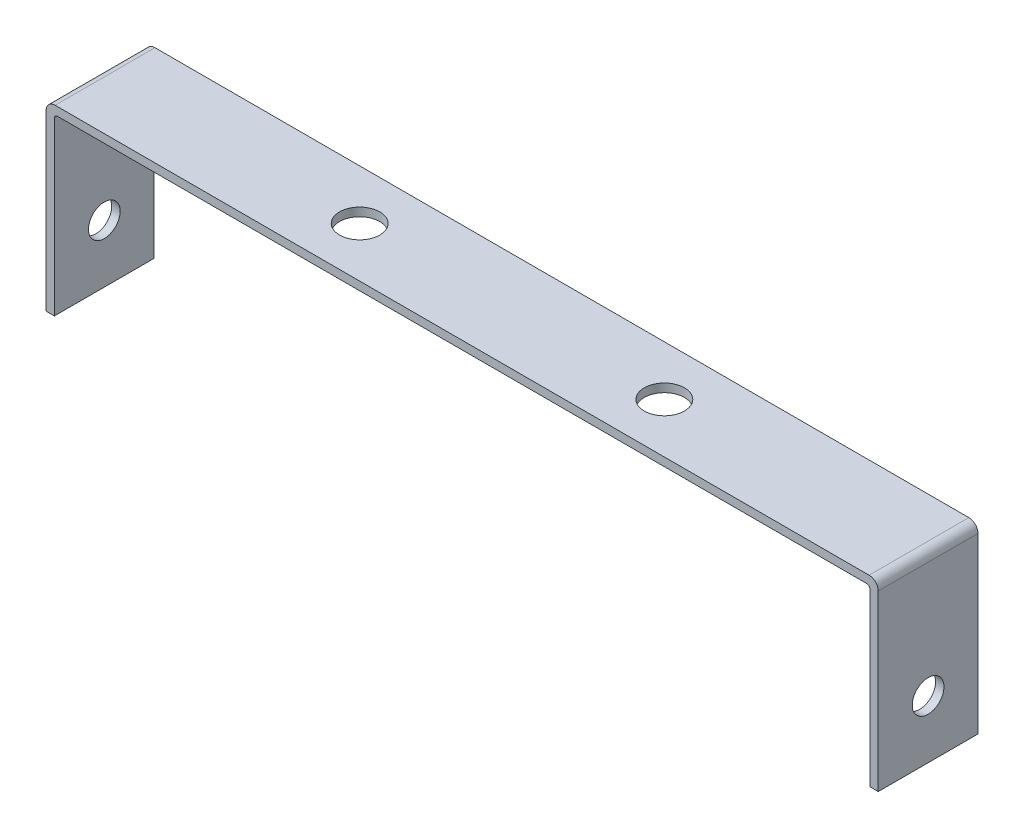
ISO-10303-21;
HEADER;
FILE_DESCRIPTION(('STEP AP214'),'2;1');
FILE_NAME('part.step','',(''),(''),'','','');
FILE_SCHEMA(('AUTOMOTIVE_DESIGN { 1 0 10303 214 1 1 1 1 }'));
ENDSEC;
DATA;
#1=APPLICATION_CONTEXT('core data for automotive mechanical design processes');
#2=APPLICATION_PROTOCOL_DEFINITION('international standard','automotive_design',2000,#1);
#3=PRODUCT_CONTEXT('',#1,'mechanical');
#4=PRODUCT('Part','Part','',(#3));
#5=PRODUCT_RELATED_PRODUCT_CATEGORY('part','',(#4));
#6=PRODUCT_DEFINITION_FORMATION('','',#4);
#7=PRODUCT_DEFINITION_CONTEXT('part definition',#1,'design');
#8=PRODUCT_DEFINITION('design','',#6,#7);
#9=PRODUCT_DEFINITION_SHAPE('','',#8);
#10=(LENGTH_UNIT() NAMED_UNIT(*) SI_UNIT(.MILLI.,.METRE.));
#11=(NAMED_UNIT(*) PLANE_ANGLE_UNIT() SI_UNIT($,.RADIAN.));
#12=(NAMED_UNIT(*) SI_UNIT($,.STERADIAN.) SOLID_ANGLE_UNIT());
#13=UNCERTAINTY_MEASURE_WITH_UNIT(LENGTH_MEASURE(1.E-05),#10,'distance_accuracy_value','');
#14=(GEOMETRIC_REPRESENTATION_CONTEXT(3) GLOBAL_UNCERTAINTY_ASSIGNED_CONTEXT((#13)) GLOBAL_UNIT_ASSIGNED_CONTEXT((#10,
#11,#12)) REPRESENTATION_CONTEXT('',''));
#15=CARTESIAN_POINT('',(0.,0.,0.));
#16=DIRECTION('',(0.,0.,1.));
#17=DIRECTION('',(1.,0.,0.));
#18=AXIS2_PLACEMENT_3D('',#15,#16,#17);
#19=CARTESIAN_POINT('',(0.,1.38,0.));
#20=DIRECTION('',(0.,1.,0.));
#21=DIRECTION('',(0.,0.,1.));
#22=AXIS2_PLACEMENT_3D('',#19,#20,#21);
#23=PLANE('',#22);
#24=CARTESIAN_POINT('',(-30.1412780743433,1.38,-20.6504197016728));
#25=DIRECTION('',(0.,1.,0.));
#26=DIRECTION('',(0.,0.,1.));
#27=AXIS2_PLACEMENT_3D('',#24,#25,#26);
#28=CIRCLE('',#27,3.3);
#29=CARTESIAN_POINT('',(-30.1412780743433,1.38,-17.3504197016728));
#30=VERTEX_POINT('',#29);
#31=EDGE_CURVE('E197',#30,#30,#28,.T.);
#32=ORIENTED_EDGE('',*,*,#31,.F.);
#33=EDGE_LOOP('',(#32));
#34=FACE_BOUND('',#33,.T.);
#35=DIRECTION('',(-1.,0.,0.));
#36=VECTOR('',#35,1.);
#37=CARTESIAN_POINT('',(-72.0412780743433,1.38,-28.8354197016728));
#38=LINE('',#37,#36);
#39=CARTESIAN_POINT('',(61.6387219256567,1.38,-28.8354197016728));
#40=VERTEX_POINT('',#39);
#41=CARTESIAN_POINT('',(-71.9212780743433,1.38,-28.8354197016728));
#42=VERTEX_POINT('',#41);
#43=EDGE_CURVE('E206',#40,#42,#38,.T.);
#44=ORIENTED_EDGE('',*,*,#43,.T.);
#45=DIRECTION('',(0.,0.,1.));
#46=VECTOR('',#45,1.);
#47=CARTESIAN_POINT('',(-71.9212780743433,1.38,0.));
#48=LINE('',#47,#46);
#49=CARTESIAN_POINT('',(-71.9212780743433,1.38,-12.4654197016728));
#50=VERTEX_POINT('',#49);
#51=EDGE_CURVE('E285',#42,#50,#48,.T.);
#52=ORIENTED_EDGE('',*,*,#51,.T.);
#53=DIRECTION('',(1.,0.,0.));
#54=VECTOR('',#53,1.);
#55=CARTESIAN_POINT('',(-72.0412780743433,1.38,-12.4654197016728));
#56=LINE('',#55,#54);
#57=CARTESIAN_POINT('',(61.6387219256567,1.38,-12.4654197016728));
#58=VERTEX_POINT('',#57);
#59=EDGE_CURVE('E203',#50,#58,#56,.T.);
#60=ORIENTED_EDGE('',*,*,#59,.T.);
#61=DIRECTION('',(0.,0.,-1.));
#62=VECTOR('',#61,1.);
#63=CARTESIAN_POINT('',(61.6387219256567,1.38,0.));
#64=LINE('',#63,#62);
#65=EDGE_CURVE('E210',#58,#40,#64,.T.);
#66=ORIENTED_EDGE('',*,*,#65,.T.);
#67=EDGE_LOOP('',(#44,#52,#60,#66));
#68=FACE_BOUND('',#67,.T.);
#69=CARTESIAN_POINT('',(19.8587219256567,1.38,-20.6504197016728));
#70=DIRECTION('',(0.,1.,0.));
#71=DIRECTION('',(0.,0.,1.));
#72=AXIS2_PLACEMENT_3D('',#69,#70,#71);
#73=CIRCLE('',#72,3.3);
#74=CARTESIAN_POINT('',(19.8587219256567,1.38,-17.3504197016728));
#75=VERTEX_POINT('',#74);
#76=EDGE_CURVE('E191',#75,#75,#73,.T.);
#77=ORIENTED_EDGE('',*,*,#76,.F.);
#78=EDGE_LOOP('',(#77));
#79=FACE_BOUND('',#78,.T.);
#80=ADVANCED_FACE('F37',(#34,#68,#79),#23,.T.);
#81=CARTESIAN_POINT('',(0.,0.,0.));
#82=DIRECTION('',(0.,1.,0.));
#83=DIRECTION('',(0.,0.,1.));
#84=AXIS2_PLACEMENT_3D('',#81,#82,#83);
#85=PLANE('',#84);
#86=CARTESIAN_POINT('',(-30.1412780743433,0.,-20.6504197016728));
#87=DIRECTION('',(0.,1.,0.));
#88=DIRECTION('',(0.,0.,1.));
#89=AXIS2_PLACEMENT_3D('',#86,#87,#88);
#90=CIRCLE('',#89,3.3);
#91=CARTESIAN_POINT('',(-30.1412780743433,0.,-17.3504197016728));
#92=VERTEX_POINT('',#91);
#93=EDGE_CURVE('E194',#92,#92,#90,.T.);
#94=ORIENTED_EDGE('',*,*,#93,.T.);
#95=EDGE_LOOP('',(#94));
#96=FACE_BOUND('',#95,.T.);
#97=DIRECTION('',(1.,0.,0.));
#98=VECTOR('',#97,1.);
#99=CARTESIAN_POINT('',(-72.0412780743433,0.,-12.4654197016728));
#100=LINE('',#99,#98);
#101=CARTESIAN_POINT('',(-71.5412780743433,0.,-12.4654197016728));
#102=VERTEX_POINT('',#101);
#103=CARTESIAN_POINT('',(61.2587219256567,0.,-12.4654197016728));
#104=VERTEX_POINT('',#103);
#105=EDGE_CURVE('E200',#102,#104,#100,.T.);
#106=ORIENTED_EDGE('',*,*,#105,.F.);
#107=DIRECTION('',(0.,0.,1.));
#108=VECTOR('',#107,1.);
#109=CARTESIAN_POINT('',(-71.5412780743433,0.,0.));
#110=LINE('',#109,#108);
#111=CARTESIAN_POINT('',(-71.5412780743433,0.,-28.8354197016728));
#112=VERTEX_POINT('',#111);
#113=EDGE_CURVE('E221',#102,#112,#110,.F.);
#114=ORIENTED_EDGE('',*,*,#113,.T.);
#115=DIRECTION('',(-1.,0.,0.));
#116=VECTOR('',#115,1.);
#117=CARTESIAN_POINT('',(-72.0412780743433,0.,-28.8354197016728));
#118=LINE('',#117,#116);
#119=CARTESIAN_POINT('',(61.2587219256567,0.,-28.8354197016728));
#120=VERTEX_POINT('',#119);
#121=EDGE_CURVE('E207',#120,#112,#118,.T.);
#122=ORIENTED_EDGE('',*,*,#121,.F.);
#123=DIRECTION('',(0.,0.,-1.));
#124=VECTOR('',#123,1.);
#125=CARTESIAN_POINT('',(61.2587219256567,0.,0.));
#126=LINE('',#125,#124);
#127=EDGE_CURVE('E219',#120,#104,#126,.F.);
#128=ORIENTED_EDGE('',*,*,#127,.T.);
#129=EDGE_LOOP('',(#106,#114,#122,#128));
#130=FACE_BOUND('',#129,.T.);
#131=CARTESIAN_POINT('',(19.8587219256567,0.,-20.6504197016728));
#132=DIRECTION('',(0.,1.,0.));
#133=DIRECTION('',(0.,0.,1.));
#134=AXIS2_PLACEMENT_3D('',#131,#132,#133);
#135=CIRCLE('',#134,3.3);
#136=CARTESIAN_POINT('',(19.8587219256567,0.,-17.3504197016728));
#137=VERTEX_POINT('',#136);
#138=EDGE_CURVE('E186',#137,#137,#135,.T.);
#139=ORIENTED_EDGE('',*,*,#138,.T.);
#140=EDGE_LOOP('',(#139));
#141=FACE_BOUND('',#140,.T.);
#142=ADVANCED_FACE('F237',(#96,#130,#141),#85,.F.);
#143=CARTESIAN_POINT('',(-72.0412780743433,1.38,-12.4654197016728));
#144=DIRECTION('',(0.,0.,-1.));
#145=DIRECTION('',(-1.,0.,0.));
#146=AXIS2_PLACEMENT_3D('',#143,#144,#145);
#147=PLANE('',#146);
#148=ORIENTED_EDGE('',*,*,#59,.F.);
#149=CARTESIAN_POINT('',(-71.9212780743433,-0.12,-12.4654197016728));
#150=DIRECTION('',(0.,0.,-1.));
#151=DIRECTION('',(-1.,0.,0.));
#152=AXIS2_PLACEMENT_3D('',#149,#150,#151);
#153=CIRCLE('',#152,1.5);
#154=CARTESIAN_POINT('',(-73.4212780743433,-0.119999999999999,-12.4654197016728));
#155=VERTEX_POINT('',#154);
#156=EDGE_CURVE('E284',#50,#155,#153,.F.);
#157=ORIENTED_EDGE('',*,*,#156,.T.);
#158=DIRECTION('',(0.,1.,0.));
#159=VECTOR('',#158,1.);
#160=CARTESIAN_POINT('',(-73.4212780743433,-28.62,-12.4654197016728));
#161=LINE('',#160,#159);
#162=CARTESIAN_POINT('',(-73.4212780743433,-28.62,-12.4654197016728));
#163=VERTEX_POINT('',#162);
#164=EDGE_CURVE('E179',#163,#155,#161,.T.);
#165=ORIENTED_EDGE('',*,*,#164,.F.);
#166=DIRECTION('',(1.,0.,0.));
#167=VECTOR('',#166,1.);
#168=CARTESIAN_POINT('',(-72.0412780743433,-28.62,-12.4654197016728));
#169=LINE('',#168,#167);
#170=CARTESIAN_POINT('',(-72.0412780743433,-28.62,-12.4654197016728));
#171=VERTEX_POINT('',#170);
#172=EDGE_CURVE('E173',#163,#171,#169,.T.);
#173=ORIENTED_EDGE('',*,*,#172,.T.);
#174=DIRECTION('',(0.,1.,0.));
#175=VECTOR('',#174,1.);
#176=CARTESIAN_POINT('',(-72.0412780743433,-28.62,-12.4654197016728));
#177=LINE('',#176,#175);
#178=CARTESIAN_POINT('',(-72.0412780743433,-0.5,-12.4654197016728));
#179=VERTEX_POINT('',#178);
#180=EDGE_CURVE('E182',#171,#179,#177,.T.);
#181=ORIENTED_EDGE('',*,*,#180,.T.);
#182=CARTESIAN_POINT('',(-71.5412780743433,-0.5,-12.4654197016728));
#183=DIRECTION('',(0.,0.,-1.));
#184=DIRECTION('',(-1.,0.,0.));
#185=AXIS2_PLACEMENT_3D('',#182,#183,#184);
#186=CIRCLE('',#185,0.5);
#187=EDGE_CURVE('E226',#179,#102,#186,.T.);
#188=ORIENTED_EDGE('',*,*,#187,.T.);
#189=ORIENTED_EDGE('',*,*,#105,.T.);
#190=CARTESIAN_POINT('',(61.2587219256567,-0.5,-12.4654197016728));
#191=DIRECTION('',(0.,0.,-1.));
#192=DIRECTION('',(-1.,0.,0.));
#193=AXIS2_PLACEMENT_3D('',#190,#191,#192);
#194=CIRCLE('',#193,0.5);
#195=CARTESIAN_POINT('',(61.7587219256567,-0.5,-12.4654197016728));
#196=VERTEX_POINT('',#195);
#197=EDGE_CURVE('E11',#104,#196,#194,.T.);
#198=ORIENTED_EDGE('',*,*,#197,.T.);
#199=DIRECTION('',(0.,1.,0.));
#200=VECTOR('',#199,1.);
#201=CARTESIAN_POINT('',(61.7587219256567,-28.62,-12.4654197016728));
#202=LINE('',#201,#200);
#203=CARTESIAN_POINT('',(61.7587219256567,-28.62,-12.4654197016728));
#204=VERTEX_POINT('',#203);
#205=EDGE_CURVE('E123',#204,#196,#202,.T.);
#206=ORIENTED_EDGE('',*,*,#205,.F.);
#207=DIRECTION('',(1.,0.,0.));
#208=VECTOR('',#207,1.);
#209=CARTESIAN_POINT('',(61.7587219256567,-28.62,-12.4654197016728));
#210=LINE('',#209,#208);
#211=CARTESIAN_POINT('',(63.1387219256567,-28.62,-12.4654197016728));
#212=VERTEX_POINT('',#211);
#213=EDGE_CURVE('E128',#204,#212,#210,.T.);
#214=ORIENTED_EDGE('',*,*,#213,.T.);
#215=DIRECTION('',(0.,1.,0.));
#216=VECTOR('',#215,1.);
#217=CARTESIAN_POINT('',(63.1387219256567,-28.62,-12.4654197016728));
#218=LINE('',#217,#216);
#219=CARTESIAN_POINT('',(63.1387219256567,-0.119999999999999,-12.4654197016728));
#220=VERTEX_POINT('',#219);
#221=EDGE_CURVE('E131',#212,#220,#218,.T.);
#222=ORIENTED_EDGE('',*,*,#221,.T.);
#223=CARTESIAN_POINT('',(61.6387219256567,-0.12,-12.4654197016728));
#224=DIRECTION('',(0.,0.,-1.));
#225=DIRECTION('',(-1.,0.,0.));
#226=AXIS2_PLACEMENT_3D('',#223,#224,#225);
#227=CIRCLE('',#226,1.5);
#228=EDGE_CURVE('E281',#220,#58,#227,.F.);
#229=ORIENTED_EDGE('',*,*,#228,.T.);
#230=EDGE_LOOP('',(#148,#157,#165,#173,#181,#188,#189,#198,#206,#214,#222,#229));
#231=FACE_BOUND('',#230,.T.);
#232=ADVANCED_FACE('F126',(#231),#147,.F.);
#233=CARTESIAN_POINT('',(-72.0412780743433,1.38,-28.8354197016728));
#234=DIRECTION('',(0.,0.,1.));
#235=DIRECTION('',(1.,0.,0.));
#236=AXIS2_PLACEMENT_3D('',#233,#234,#235);
#237=PLANE('',#236);
#238=DIRECTION('',(0.,1.,0.));
#239=VECTOR('',#238,1.);
#240=CARTESIAN_POINT('',(-73.4212780743433,-28.62,-28.8354197016728));
#241=LINE('',#240,#239);
#242=CARTESIAN_POINT('',(-73.4212780743433,-28.62,-28.8354197016728));
#243=VERTEX_POINT('',#242);
#244=CARTESIAN_POINT('',(-73.4212780743433,-0.119999999999999,-28.8354197016728));
#245=VERTEX_POINT('',#244);
#246=EDGE_CURVE('E190',#243,#245,#241,.T.);
#247=ORIENTED_EDGE('',*,*,#246,.T.);
#248=CARTESIAN_POINT('',(-71.9212780743433,-0.12,-28.8354197016728));
#249=DIRECTION('',(0.,0.,1.));
#250=DIRECTION('',(1.,0.,0.));
#251=AXIS2_PLACEMENT_3D('',#248,#249,#250);
#252=CIRCLE('',#251,1.5);
#253=EDGE_CURVE('E295',#245,#42,#252,.F.);
#254=ORIENTED_EDGE('',*,*,#253,.T.);
#255=ORIENTED_EDGE('',*,*,#43,.F.);
#256=CARTESIAN_POINT('',(61.6387219256567,-0.12,-28.8354197016728));
#257=DIRECTION('',(0.,0.,1.));
#258=DIRECTION('',(1.,0.,0.));
#259=AXIS2_PLACEMENT_3D('',#256,#257,#258);
#260=CIRCLE('',#259,1.5);
#261=CARTESIAN_POINT('',(63.1387219256567,-0.119999999999999,-28.8354197016728));
#262=VERTEX_POINT('',#261);
#263=EDGE_CURVE('E293',#40,#262,#260,.F.);
#264=ORIENTED_EDGE('',*,*,#263,.T.);
#265=DIRECTION('',(0.,1.,0.));
#266=VECTOR('',#265,1.);
#267=CARTESIAN_POINT('',(63.1387219256567,-28.62,-28.8354197016728));
#268=LINE('',#267,#266);
#269=CARTESIAN_POINT('',(63.1387219256567,-28.62,-28.8354197016728));
#270=VERTEX_POINT('',#269);
#271=EDGE_CURVE('E158',#270,#262,#268,.T.);
#272=ORIENTED_EDGE('',*,*,#271,.F.);
#273=DIRECTION('',(-1.,0.,0.));
#274=VECTOR('',#273,1.);
#275=CARTESIAN_POINT('',(61.7587219256567,-28.62,-28.8354197016728));
#276=LINE('',#275,#274);
#277=CARTESIAN_POINT('',(61.7587219256567,-28.62,-28.8354197016728));
#278=VERTEX_POINT('',#277);
#279=EDGE_CURVE('E132',#270,#278,#276,.T.);
#280=ORIENTED_EDGE('',*,*,#279,.T.);
#281=DIRECTION('',(0.,1.,0.));
#282=VECTOR('',#281,1.);
#283=CARTESIAN_POINT('',(61.7587219256567,-28.62,-28.8354197016728));
#284=LINE('',#283,#282);
#285=CARTESIAN_POINT('',(61.7587219256567,-0.5,-28.8354197016728));
#286=VERTEX_POINT('',#285);
#287=EDGE_CURVE('E146',#278,#286,#284,.T.);
#288=ORIENTED_EDGE('',*,*,#287,.T.);
#289=CARTESIAN_POINT('',(61.2587219256567,-0.5,-28.8354197016728));
#290=DIRECTION('',(0.,0.,1.));
#291=DIRECTION('',(1.,0.,0.));
#292=AXIS2_PLACEMENT_3D('',#289,#290,#291);
#293=CIRCLE('',#292,0.5);
#294=EDGE_CURVE('E45',#286,#120,#293,.T.);
#295=ORIENTED_EDGE('',*,*,#294,.T.);
#296=ORIENTED_EDGE('',*,*,#121,.T.);
#297=CARTESIAN_POINT('',(-71.5412780743433,-0.5,-28.8354197016728));
#298=DIRECTION('',(0.,0.,1.));
#299=DIRECTION('',(1.,0.,0.));
#300=AXIS2_PLACEMENT_3D('',#297,#298,#299);
#301=CIRCLE('',#300,0.5);
#302=CARTESIAN_POINT('',(-72.0412780743433,-0.5,-28.8354197016728));
#303=VERTEX_POINT('',#302);
#304=EDGE_CURVE('E228',#112,#303,#301,.T.);
#305=ORIENTED_EDGE('',*,*,#304,.T.);
#306=DIRECTION('',(0.,1.,0.));
#307=VECTOR('',#306,1.);
#308=CARTESIAN_POINT('',(-72.0412780743433,-28.62,-28.8354197016728));
#309=LINE('',#308,#307);
#310=CARTESIAN_POINT('',(-72.0412780743433,-28.62,-28.8354197016728));
#311=VERTEX_POINT('',#310);
#312=EDGE_CURVE('E176',#311,#303,#309,.T.);
#313=ORIENTED_EDGE('',*,*,#312,.F.);
#314=DIRECTION('',(-1.,0.,0.));
#315=VECTOR('',#314,1.);
#316=CARTESIAN_POINT('',(-72.0412780743433,-28.62,-28.8354197016728));
#317=LINE('',#316,#315);
#318=EDGE_CURVE('E167',#311,#243,#317,.T.);
#319=ORIENTED_EDGE('',*,*,#318,.T.);
#320=EDGE_LOOP('',(#247,#254,#255,#264,#272,#280,#288,#295,#296,#305,#313,#319));
#321=FACE_BOUND('',#320,.T.);
#322=ADVANCED_FACE('F233',(#321),#237,.F.);
#323=CARTESIAN_POINT('',(-30.1412780743433,1.38,-20.6504197016728));
#324=DIRECTION('',(0.,-1.,0.));
#325=DIRECTION('',(0.,0.,-1.));
#326=AXIS2_PLACEMENT_3D('',#323,#324,#325);
#327=CYLINDRICAL_SURFACE('',#326,3.3);
#328=ORIENTED_EDGE('',*,*,#31,.T.);
#329=EDGE_LOOP('',(#328));
#330=FACE_BOUND('',#329,.T.);
#331=ORIENTED_EDGE('',*,*,#93,.F.);
#332=EDGE_LOOP('',(#331));
#333=FACE_BOUND('',#332,.T.);
#334=ADVANCED_FACE('F263',(#330,#333),#327,.F.);
#335=CARTESIAN_POINT('',(19.8587219256567,1.38,-20.6504197016728));
#336=DIRECTION('',(0.,-1.,0.));
#337=DIRECTION('',(0.,0.,-1.));
#338=AXIS2_PLACEMENT_3D('',#335,#336,#337);
#339=CYLINDRICAL_SURFACE('',#338,3.3);
#340=ORIENTED_EDGE('',*,*,#76,.T.);
#341=EDGE_LOOP('',(#340));
#342=FACE_BOUND('',#341,.T.);
#343=ORIENTED_EDGE('',*,*,#138,.F.);
#344=EDGE_LOOP('',(#343));
#345=FACE_BOUND('',#344,.T.);
#346=ADVANCED_FACE('F323',(#342,#345),#339,.F.);
#347=CARTESIAN_POINT('',(-72.0412780743433,-28.62,-28.8354197016728));
#348=DIRECTION('',(1.,0.,0.));
#349=DIRECTION('',(0.,0.,-1.));
#350=AXIS2_PLACEMENT_3D('',#347,#348,#349);
#351=PLANE('',#350);
#352=CARTESIAN_POINT('',(-72.0412780743433,-19.12,-20.6504197016728));
#353=DIRECTION('',(1.,0.,0.));
#354=DIRECTION('',(0.,0.,-1.));
#355=AXIS2_PLACEMENT_3D('',#352,#353,#354);
#356=CIRCLE('',#355,2.6);
#357=CARTESIAN_POINT('',(-72.0412780743433,-19.12,-23.2504197016728));
#358=VERTEX_POINT('',#357);
#359=EDGE_CURVE('E147',#358,#358,#356,.T.);
#360=ORIENTED_EDGE('',*,*,#359,.F.);
#361=EDGE_LOOP('',(#360));
#362=FACE_BOUND('',#361,.T.);
#363=ORIENTED_EDGE('',*,*,#312,.T.);
#364=DIRECTION('',(0.,0.,1.));
#365=VECTOR('',#364,1.);
#366=CARTESIAN_POINT('',(-72.0412780743433,-0.5,-28.8354197016728));
#367=LINE('',#366,#365);
#368=EDGE_CURVE('E222',#303,#179,#367,.T.);
#369=ORIENTED_EDGE('',*,*,#368,.T.);
#370=ORIENTED_EDGE('',*,*,#180,.F.);
#371=DIRECTION('',(0.,0.,-1.));
#372=VECTOR('',#371,1.);
#373=CARTESIAN_POINT('',(-72.0412780743433,-28.62,-28.8354197016728));
#374=LINE('',#373,#372);
#375=EDGE_CURVE('E162',#171,#311,#374,.T.);
#376=ORIENTED_EDGE('',*,*,#375,.T.);
#377=EDGE_LOOP('',(#363,#369,#370,#376));
#378=FACE_BOUND('',#377,.T.);
#379=ADVANCED_FACE('F300',(#362,#378),#351,.T.);
#380=CARTESIAN_POINT('',(-73.4212780743433,-28.62,-28.8354197016728));
#381=DIRECTION('',(-1.,0.,0.));
#382=DIRECTION('',(0.,0.,1.));
#383=AXIS2_PLACEMENT_3D('',#380,#381,#382);
#384=PLANE('',#383);
#385=CARTESIAN_POINT('',(-73.4212780743433,-19.12,-20.6504197016728));
#386=DIRECTION('',(-1.,0.,0.));
#387=DIRECTION('',(0.,0.,1.));
#388=AXIS2_PLACEMENT_3D('',#385,#386,#387);
#389=CIRCLE('',#388,2.6);
#390=CARTESIAN_POINT('',(-73.4212780743433,-19.12,-18.0504197016728));
#391=VERTEX_POINT('',#390);
#392=EDGE_CURVE('E460',#391,#391,#389,.T.);
#393=ORIENTED_EDGE('',*,*,#392,.F.);
#394=EDGE_LOOP('',(#393));
#395=FACE_BOUND('',#394,.T.);
#396=ORIENTED_EDGE('',*,*,#164,.T.);
#397=DIRECTION('',(0.,0.,1.));
#398=VECTOR('',#397,1.);
#399=CARTESIAN_POINT('',(-73.4212780743433,-0.119999999999999,-28.8354197016728));
#400=LINE('',#399,#398);
#401=EDGE_CURVE('E287',#155,#245,#400,.F.);
#402=ORIENTED_EDGE('',*,*,#401,.T.);
#403=ORIENTED_EDGE('',*,*,#246,.F.);
#404=DIRECTION('',(0.,0.,1.));
#405=VECTOR('',#404,1.);
#406=CARTESIAN_POINT('',(-73.4212780743433,-28.62,-28.8354197016728));
#407=LINE('',#406,#405);
#408=EDGE_CURVE('E170',#243,#163,#407,.T.);
#409=ORIENTED_EDGE('',*,*,#408,.T.);
#410=EDGE_LOOP('',(#396,#402,#403,#409));
#411=FACE_BOUND('',#410,.T.);
#412=ADVANCED_FACE('F314',(#395,#411),#384,.T.);
#413=CARTESIAN_POINT('',(0.,-28.62,0.));
#414=DIRECTION('',(0.,-1.,0.));
#415=DIRECTION('',(0.,0.,-1.));
#416=AXIS2_PLACEMENT_3D('',#413,#414,#415);
#417=PLANE('',#416);
#418=ORIENTED_EDGE('',*,*,#375,.F.);
#419=ORIENTED_EDGE('',*,*,#172,.F.);
#420=ORIENTED_EDGE('',*,*,#408,.F.);
#421=ORIENTED_EDGE('',*,*,#318,.F.);
#422=EDGE_LOOP('',(#418,#419,#420,#421));
#423=FACE_BOUND('',#422,.T.);
#424=ADVANCED_FACE('F306',(#423),#417,.T.);
#425=CARTESIAN_POINT('',(61.7587219256567,-28.62,-28.8354197016728));
#426=DIRECTION('',(-1.,0.,0.));
#427=DIRECTION('',(0.,0.,1.));
#428=AXIS2_PLACEMENT_3D('',#425,#426,#427);
#429=PLANE('',#428);
#430=CARTESIAN_POINT('',(61.7587219256567,-19.12,-20.6504197016728));
#431=DIRECTION('',(-1.,0.,0.));
#432=DIRECTION('',(0.,0.,1.));
#433=AXIS2_PLACEMENT_3D('',#430,#431,#432);
#434=CIRCLE('',#433,2.6);
#435=CARTESIAN_POINT('',(61.7587219256567,-19.12,-18.0504197016728));
#436=VERTEX_POINT('',#435);
#437=EDGE_CURVE('E150',#436,#436,#434,.T.);
#438=ORIENTED_EDGE('',*,*,#437,.F.);
#439=EDGE_LOOP('',(#438));
#440=FACE_BOUND('',#439,.T.);
#441=ORIENTED_EDGE('',*,*,#205,.T.);
#442=DIRECTION('',(0.,0.,-1.));
#443=VECTOR('',#442,1.);
#444=CARTESIAN_POINT('',(61.7587219256567,-0.5,-28.8354197016728));
#445=LINE('',#444,#443);
#446=EDGE_CURVE('E224',#196,#286,#445,.T.);
#447=ORIENTED_EDGE('',*,*,#446,.T.);
#448=ORIENTED_EDGE('',*,*,#287,.F.);
#449=DIRECTION('',(0.,0.,1.));
#450=VECTOR('',#449,1.);
#451=CARTESIAN_POINT('',(61.7587219256567,-28.62,-28.8354197016728));
#452=LINE('',#451,#450);
#453=EDGE_CURVE('E139',#278,#204,#452,.T.);
#454=ORIENTED_EDGE('',*,*,#453,.T.);
#455=EDGE_LOOP('',(#441,#447,#448,#454));
#456=FACE_BOUND('',#455,.T.);
#457=ADVANCED_FACE('F144',(#440,#456),#429,.T.);
#458=CARTESIAN_POINT('',(63.1387219256567,-28.62,-28.8354197016728));
#459=DIRECTION('',(1.,0.,0.));
#460=DIRECTION('',(0.,0.,-1.));
#461=AXIS2_PLACEMENT_3D('',#458,#459,#460);
#462=PLANE('',#461);
#463=CARTESIAN_POINT('',(63.1387219256567,-19.12,-20.6504197016728));
#464=DIRECTION('',(-1.,0.,0.));
#465=DIRECTION('',(0.,0.,1.));
#466=AXIS2_PLACEMENT_3D('',#463,#464,#465);
#467=CIRCLE('',#466,2.6);
#468=CARTESIAN_POINT('',(63.1387219256567,-19.12,-18.0504197016728));
#469=VERTEX_POINT('',#468);
#470=EDGE_CURVE('E461',#469,#469,#467,.T.);
#471=ORIENTED_EDGE('',*,*,#470,.T.);
#472=EDGE_LOOP('',(#471));
#473=FACE_BOUND('',#472,.T.);
#474=ORIENTED_EDGE('',*,*,#271,.T.);
#475=DIRECTION('',(0.,0.,-1.));
#476=VECTOR('',#475,1.);
#477=CARTESIAN_POINT('',(63.1387219256567,-0.119999999999999,-28.8354197016728));
#478=LINE('',#477,#476);
#479=EDGE_CURVE('E282',#262,#220,#478,.F.);
#480=ORIENTED_EDGE('',*,*,#479,.T.);
#481=ORIENTED_EDGE('',*,*,#221,.F.);
#482=DIRECTION('',(0.,0.,-1.));
#483=VECTOR('',#482,1.);
#484=CARTESIAN_POINT('',(63.1387219256567,-28.62,-28.8354197016728));
#485=LINE('',#484,#483);
#486=EDGE_CURVE('E142',#212,#270,#485,.T.);
#487=ORIENTED_EDGE('',*,*,#486,.T.);
#488=EDGE_LOOP('',(#474,#480,#481,#487));
#489=FACE_BOUND('',#488,.T.);
#490=ADVANCED_FACE('F382',(#473,#489),#462,.T.);
#491=CARTESIAN_POINT('',(0.,-28.62,0.));
#492=DIRECTION('',(0.,1.,0.));
#493=DIRECTION('',(0.,0.,1.));
#494=AXIS2_PLACEMENT_3D('',#491,#492,#493);
#495=PLANE('',#494);
#496=ORIENTED_EDGE('',*,*,#453,.F.);
#497=ORIENTED_EDGE('',*,*,#279,.F.);
#498=ORIENTED_EDGE('',*,*,#486,.F.);
#499=ORIENTED_EDGE('',*,*,#213,.F.);
#500=EDGE_LOOP('',(#496,#497,#498,#499));
#501=FACE_BOUND('',#500,.T.);
#502=ADVANCED_FACE('F137',(#501),#495,.F.);
#503=CARTESIAN_POINT('',(-71.9212780743433,-0.12,0.));
#504=DIRECTION('',(0.,0.,1.));
#505=DIRECTION('',(1.,0.,0.));
#506=AXIS2_PLACEMENT_3D('',#503,#504,#505);
#507=CYLINDRICAL_SURFACE('',#506,1.5);
#508=ORIENTED_EDGE('',*,*,#253,.F.);
#509=ORIENTED_EDGE('',*,*,#401,.F.);
#510=ORIENTED_EDGE('',*,*,#156,.F.);
#511=ORIENTED_EDGE('',*,*,#51,.F.);
#512=EDGE_LOOP('',(#508,#509,#510,#511));
#513=FACE_BOUND('',#512,.T.);
#514=ADVANCED_FACE('F270',(#513),#507,.T.);
#515=CARTESIAN_POINT('',(61.6387219256567,-0.12,0.));
#516=DIRECTION('',(0.,0.,-1.));
#517=DIRECTION('',(-1.,0.,0.));
#518=AXIS2_PLACEMENT_3D('',#515,#516,#517);
#519=CYLINDRICAL_SURFACE('',#518,1.5);
#520=ORIENTED_EDGE('',*,*,#228,.F.);
#521=ORIENTED_EDGE('',*,*,#479,.F.);
#522=ORIENTED_EDGE('',*,*,#263,.F.);
#523=ORIENTED_EDGE('',*,*,#65,.F.);
#524=EDGE_LOOP('',(#520,#521,#522,#523));
#525=FACE_BOUND('',#524,.T.);
#526=ADVANCED_FACE('F250',(#525),#519,.T.);
#527=CARTESIAN_POINT('',(-71.5412780743433,-0.5,-28.8354197016728));
#528=DIRECTION('',(0.,0.,1.));
#529=DIRECTION('',(1.,0.,0.));
#530=AXIS2_PLACEMENT_3D('',#527,#528,#529);
#531=CYLINDRICAL_SURFACE('',#530,0.5);
#532=ORIENTED_EDGE('',*,*,#304,.F.);
#533=ORIENTED_EDGE('',*,*,#113,.F.);
#534=ORIENTED_EDGE('',*,*,#187,.F.);
#535=ORIENTED_EDGE('',*,*,#368,.F.);
#536=EDGE_LOOP('',(#532,#533,#534,#535));
#537=FACE_BOUND('',#536,.T.);
#538=ADVANCED_FACE('F242',(#537),#531,.F.);
#539=CARTESIAN_POINT('',(61.2587219256567,-0.5,-28.8354197016728));
#540=DIRECTION('',(0.,0.,-1.));
#541=DIRECTION('',(-1.,0.,0.));
#542=AXIS2_PLACEMENT_3D('',#539,#540,#541);
#543=CYLINDRICAL_SURFACE('',#542,0.5);
#544=ORIENTED_EDGE('',*,*,#197,.F.);
#545=ORIENTED_EDGE('',*,*,#127,.F.);
#546=ORIENTED_EDGE('',*,*,#294,.F.);
#547=ORIENTED_EDGE('',*,*,#446,.F.);
#548=EDGE_LOOP('',(#544,#545,#546,#547));
#549=FACE_BOUND('',#548,.T.);
#550=ADVANCED_FACE('F39',(#549),#543,.F.);
#551=CARTESIAN_POINT('',(63.1387219256567,-19.12,-20.6504197016728));
#552=DIRECTION('',(-1.,0.,0.));
#553=DIRECTION('',(0.,0.,1.));
#554=AXIS2_PLACEMENT_3D('',#551,#552,#553);
#555=CYLINDRICAL_SURFACE('',#554,2.6);
#556=ORIENTED_EDGE('',*,*,#437,.T.);
#557=EDGE_LOOP('',(#556));
#558=FACE_BOUND('',#557,.T.);
#559=ORIENTED_EDGE('',*,*,#470,.F.);
#560=EDGE_LOOP('',(#559));
#561=FACE_BOUND('',#560,.T.);
#562=ADVANCED_FACE('F241',(#558,#561),#555,.F.);
#563=ORIENTED_EDGE('',*,*,#359,.T.);
#564=EDGE_LOOP('',(#563));
#565=FACE_BOUND('',#564,.T.);
#566=ORIENTED_EDGE('',*,*,#392,.T.);
#567=EDGE_LOOP('',(#566));
#568=FACE_BOUND('',#567,.T.);
#569=ADVANCED_FACE('F247',(#565,#568),#555,.F.);
#570=CLOSED_SHELL('',(#80,#142,#232,#322,#334,#346,#379,#412,#424,#457,#490,#502,#514,#526,#538,
#550,#562,#569));
#571=MANIFOLD_SOLID_BREP('B2',#570);
#572=ADVANCED_BREP_SHAPE_REPRESENTATION('',(#18,#571),#14);
#573=SHAPE_DEFINITION_REPRESENTATION(#9,#572);
ENDSEC;
END-ISO-10303-21;
